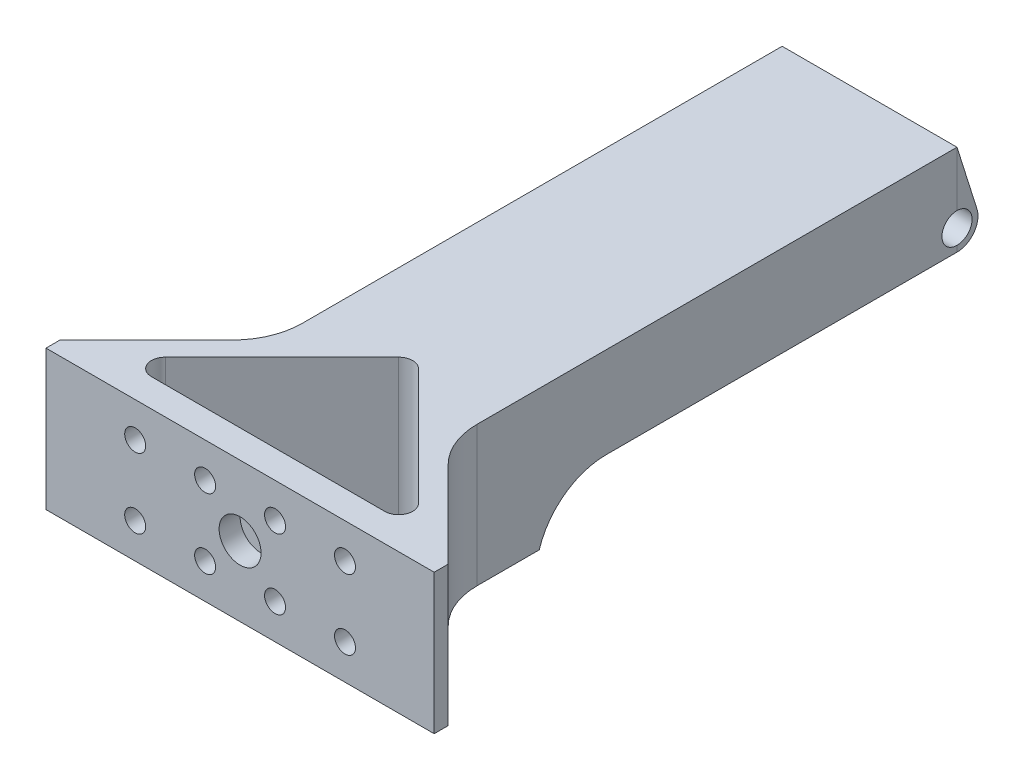
ISO-10303-21;
HEADER;
FILE_DESCRIPTION(('STEP AP214'),'2;1');
FILE_NAME('part.step','',(''),(''),'','','');
FILE_SCHEMA(('AUTOMOTIVE_DESIGN { 1 0 10303 214 1 1 1 1 }'));
ENDSEC;
DATA;
#1=APPLICATION_CONTEXT('core data for automotive mechanical design processes');
#2=APPLICATION_PROTOCOL_DEFINITION('international standard','automotive_design',2000,#1);
#3=PRODUCT_CONTEXT('',#1,'mechanical');
#4=PRODUCT('Part','Part','',(#3));
#5=PRODUCT_RELATED_PRODUCT_CATEGORY('part','',(#4));
#6=PRODUCT_DEFINITION_FORMATION('','',#4);
#7=PRODUCT_DEFINITION_CONTEXT('part definition',#1,'design');
#8=PRODUCT_DEFINITION('design','',#6,#7);
#9=PRODUCT_DEFINITION_SHAPE('','',#8);
#10=(LENGTH_UNIT() NAMED_UNIT(*) SI_UNIT(.MILLI.,.METRE.));
#11=(NAMED_UNIT(*) PLANE_ANGLE_UNIT() SI_UNIT($,.RADIAN.));
#12=(NAMED_UNIT(*) SI_UNIT($,.STERADIAN.) SOLID_ANGLE_UNIT());
#13=UNCERTAINTY_MEASURE_WITH_UNIT(LENGTH_MEASURE(1.E-05),#10,'distance_accuracy_value','');
#14=(GEOMETRIC_REPRESENTATION_CONTEXT(3) GLOBAL_UNCERTAINTY_ASSIGNED_CONTEXT((#13)) GLOBAL_UNIT_ASSIGNED_CONTEXT((#10,
#11,#12)) REPRESENTATION_CONTEXT('',''));
#15=CARTESIAN_POINT('',(0.,0.,0.));
#16=DIRECTION('',(0.,0.,1.));
#17=DIRECTION('',(1.,0.,0.));
#18=AXIS2_PLACEMENT_3D('',#15,#16,#17);
#19=CARTESIAN_POINT('',(40.2522932701939,0.,-90.));
#20=DIRECTION('',(0.,0.,-1.));
#21=DIRECTION('',(-1.,0.,0.));
#22=AXIS2_PLACEMENT_3D('',#19,#20,#21);
#23=PLANE('',#22);
#24=DIRECTION('',(0.,-1.,0.));
#25=VECTOR('',#24,1.);
#26=CARTESIAN_POINT('',(40.2522932701939,0.,-90.));
#27=LINE('',#26,#25);
#28=CARTESIAN_POINT('',(40.2522932701939,7.85000031001889,-90.));
#29=VERTEX_POINT('',#28);
#30=CARTESIAN_POINT('',(40.2522932701939,7.,-90.));
#31=VERTEX_POINT('',#30);
#32=EDGE_CURVE('E209',#29,#31,#27,.T.);
#33=ORIENTED_EDGE('',*,*,#32,.F.);
#34=DIRECTION('',(-1.,0.,0.));
#35=VECTOR('',#34,1.);
#36=CARTESIAN_POINT('',(55.5,7.85000031001889,-90.));
#37=LINE('',#36,#35);
#38=CARTESIAN_POINT('',(40.2477067298061,7.85000031001889,-90.));
#39=VERTEX_POINT('',#38);
#40=EDGE_CURVE('E187',#29,#39,#37,.T.);
#41=ORIENTED_EDGE('',*,*,#40,.T.);
#42=DIRECTION('',(0.,-1.,0.));
#43=VECTOR('',#42,1.);
#44=CARTESIAN_POINT('',(40.2477067298061,20.,-90.));
#45=LINE('',#44,#43);
#46=CARTESIAN_POINT('',(40.2477067298061,7.,-90.));
#47=VERTEX_POINT('',#46);
#48=EDGE_CURVE('E365',#39,#47,#45,.T.);
#49=ORIENTED_EDGE('',*,*,#48,.T.);
#50=DIRECTION('',(-1.,0.,0.));
#51=VECTOR('',#50,1.);
#52=CARTESIAN_POINT('',(40.2522932701939,7.,-90.));
#53=LINE('',#52,#51);
#54=EDGE_CURVE('E226',#31,#47,#53,.T.);
#55=ORIENTED_EDGE('',*,*,#54,.F.);
#56=EDGE_LOOP('',(#33,#41,#49,#55));
#57=FACE_BOUND('',#56,.T.);
#58=ADVANCED_FACE('F34',(#57),#23,.F.);
#59=CARTESIAN_POINT('',(0.,20.,0.));
#60=DIRECTION('',(0.,1.,0.));
#61=DIRECTION('',(0.,0.,1.));
#62=AXIS2_PLACEMENT_3D('',#59,#60,#61);
#63=PLANE('',#62);
#64=DIRECTION('',(1.,0.,0.));
#65=VECTOR('',#64,1.);
#66=CARTESIAN_POINT('',(55.5,20.,0.));
#67=LINE('',#66,#65);
#68=CARTESIAN_POINT('',(0.,20.,0.));
#69=VERTEX_POINT('',#68);
#70=CARTESIAN_POINT('',(55.5,20.,0.));
#71=VERTEX_POINT('',#70);
#72=EDGE_CURVE('E323',#69,#71,#67,.T.);
#73=ORIENTED_EDGE('',*,*,#72,.T.);
#74=DIRECTION('',(0.,0.,-1.));
#75=VECTOR('',#74,1.);
#76=CARTESIAN_POINT('',(55.5,20.,-2.));
#77=LINE('',#76,#75);
#78=CARTESIAN_POINT('',(55.5,20.,-2.));
#79=VERTEX_POINT('',#78);
#80=EDGE_CURVE('E326',#71,#79,#77,.T.);
#81=ORIENTED_EDGE('',*,*,#80,.T.);
#82=DIRECTION('',(-0.707106781186547,0.,-0.707106781186548));
#83=VECTOR('',#82,1.);
#84=CARTESIAN_POINT('',(40.2477067298062,20.,-17.2522932701938));
#85=LINE('',#84,#83);
#86=CARTESIAN_POINT('',(43.1766389179407,20.,-14.3233610820593));
#87=VERTEX_POINT('',#86);
#88=EDGE_CURVE('E329',#79,#87,#85,.T.);
#89=ORIENTED_EDGE('',*,*,#88,.T.);
#90=CARTESIAN_POINT('',(50.2477067298062,20.,-21.3944288939248));
#91=DIRECTION('',(0.,1.,0.));
#92=DIRECTION('',(0.,0.,1.));
#93=AXIS2_PLACEMENT_3D('',#90,#91,#92);
#94=CIRCLE('',#93,10.);
#95=CARTESIAN_POINT('',(40.2477067298062,20.,-21.3944288939248));
#96=VERTEX_POINT('',#95);
#97=EDGE_CURVE('E405',#87,#96,#94,.F.);
#98=ORIENTED_EDGE('',*,*,#97,.T.);
#99=DIRECTION('',(0.,0.,-1.));
#100=VECTOR('',#99,1.);
#101=CARTESIAN_POINT('',(40.2477067298061,20.,-90.));
#102=LINE('',#101,#100);
#103=CARTESIAN_POINT('',(40.2477067298061,20.,-90.));
#104=VERTEX_POINT('',#103);
#105=EDGE_CURVE('E332',#96,#104,#102,.T.);
#106=ORIENTED_EDGE('',*,*,#105,.T.);
#107=DIRECTION('',(-1.,0.,0.));
#108=VECTOR('',#107,1.);
#109=CARTESIAN_POINT('',(40.2477067298061,20.,-90.));
#110=LINE('',#109,#108);
#111=CARTESIAN_POINT('',(15.2522932701939,20.,-90.));
#112=VERTEX_POINT('',#111);
#113=EDGE_CURVE('E334',#104,#112,#110,.T.);
#114=ORIENTED_EDGE('',*,*,#113,.T.);
#115=DIRECTION('',(0.,0.,1.));
#116=VECTOR('',#115,1.);
#117=CARTESIAN_POINT('',(15.2522932701938,20.,-90.));
#118=LINE('',#117,#116);
#119=CARTESIAN_POINT('',(15.2522932701938,20.,-21.3944288939248));
#120=VERTEX_POINT('',#119);
#121=EDGE_CURVE('E337',#112,#120,#118,.T.);
#122=ORIENTED_EDGE('',*,*,#121,.T.);
#123=CARTESIAN_POINT('',(5.25229327019384,20.,-21.3944288939248));
#124=DIRECTION('',(0.,1.,0.));
#125=DIRECTION('',(0.,0.,1.));
#126=AXIS2_PLACEMENT_3D('',#123,#124,#125);
#127=CIRCLE('',#126,10.);
#128=CARTESIAN_POINT('',(12.3233610820593,20.,-14.3233610820593));
#129=VERTEX_POINT('',#128);
#130=EDGE_CURVE('E401',#120,#129,#127,.F.);
#131=ORIENTED_EDGE('',*,*,#130,.T.);
#132=DIRECTION('',(-0.707106781186547,0.,0.707106781186548));
#133=VECTOR('',#132,1.);
#134=CARTESIAN_POINT('',(15.2522932701938,20.,-17.2522932701938));
#135=LINE('',#134,#133);
#136=CARTESIAN_POINT('',(0.,20.,-2.));
#137=VERTEX_POINT('',#136);
#138=EDGE_CURVE('E340',#129,#137,#135,.T.);
#139=ORIENTED_EDGE('',*,*,#138,.T.);
#140=DIRECTION('',(0.,0.,1.));
#141=VECTOR('',#140,1.);
#142=CARTESIAN_POINT('',(0.,20.,-2.));
#143=LINE('',#142,#141);
#144=EDGE_CURVE('E342',#137,#69,#143,.T.);
#145=ORIENTED_EDGE('',*,*,#144,.T.);
#146=EDGE_LOOP('',(#73,#81,#89,#98,#106,#114,#122,#131,#139,#145));
#147=FACE_BOUND('',#146,.T.);
#148=DIRECTION('',(-0.707106781186548,0.,-0.707106781186547));
#149=VECTOR('',#148,1.);
#150=CARTESIAN_POINT('',(45.8431457505076,20.,-7.4142135623731));
#151=LINE('',#150,#149);
#152=CARTESIAN_POINT('',(45.8431457505076,20.,-7.4142135623731));
#153=VERTEX_POINT('',#152);
#154=CARTESIAN_POINT('',(29.1642135623731,20.,-24.0931457505076));
#155=VERTEX_POINT('',#154);
#156=EDGE_CURVE('E279',#153,#155,#151,.T.);
#157=ORIENTED_EDGE('',*,*,#156,.F.);
#158=CARTESIAN_POINT('',(44.4289321881345,20.,-6.));
#159=DIRECTION('',(0.,1.,0.));
#160=DIRECTION('',(0.,0.,1.));
#161=AXIS2_PLACEMENT_3D('',#158,#159,#160);
#162=CIRCLE('',#161,2.);
#163=CARTESIAN_POINT('',(44.4289321881345,20.,-4.));
#164=VERTEX_POINT('',#163);
#165=EDGE_CURVE('E277',#164,#153,#162,.T.);
#166=ORIENTED_EDGE('',*,*,#165,.F.);
#167=DIRECTION('',(1.,0.,0.));
#168=VECTOR('',#167,1.);
#169=CARTESIAN_POINT('',(11.0710678118655,20.,-3.99999999999999));
#170=LINE('',#169,#168);
#171=CARTESIAN_POINT('',(11.0710678118655,20.,-3.99999999999999));
#172=VERTEX_POINT('',#171);
#173=EDGE_CURVE('E289',#172,#164,#170,.T.);
#174=ORIENTED_EDGE('',*,*,#173,.F.);
#175=CARTESIAN_POINT('',(11.0710678118655,20.,-5.99999999999999));
#176=DIRECTION('',(0.,1.,0.));
#177=DIRECTION('',(0.,0.,1.));
#178=AXIS2_PLACEMENT_3D('',#175,#176,#177);
#179=CIRCLE('',#178,2.);
#180=CARTESIAN_POINT('',(9.65685424949239,20.,-7.41421356237309));
#181=VERTEX_POINT('',#180);
#182=EDGE_CURVE('E286',#181,#172,#179,.T.);
#183=ORIENTED_EDGE('',*,*,#182,.F.);
#184=DIRECTION('',(-0.707106781186547,0.,0.707106781186548));
#185=VECTOR('',#184,1.);
#186=CARTESIAN_POINT('',(9.65685424949239,20.,-7.41421356237309));
#187=LINE('',#186,#185);
#188=CARTESIAN_POINT('',(26.3357864376269,20.,-24.0931457505076));
#189=VERTEX_POINT('',#188);
#190=EDGE_CURVE('E284',#189,#181,#187,.T.);
#191=ORIENTED_EDGE('',*,*,#190,.F.);
#192=CARTESIAN_POINT('',(27.75,20.,-22.6789321881345));
#193=DIRECTION('',(0.,1.,0.));
#194=DIRECTION('',(0.,0.,1.));
#195=AXIS2_PLACEMENT_3D('',#192,#193,#194);
#196=CIRCLE('',#195,2.);
#197=EDGE_CURVE('E282',#155,#189,#196,.T.);
#198=ORIENTED_EDGE('',*,*,#197,.F.);
#199=EDGE_LOOP('',(#157,#166,#174,#183,#191,#198));
#200=FACE_BOUND('',#199,.T.);
#201=ADVANCED_FACE('F465',(#147,#200),#63,.T.);
#202=CARTESIAN_POINT('',(0.,0.,0.));
#203=DIRECTION('',(0.,1.,0.));
#204=DIRECTION('',(0.,0.,1.));
#205=AXIS2_PLACEMENT_3D('',#202,#203,#204);
#206=PLANE('',#205);
#207=DIRECTION('',(0.,0.,1.));
#208=VECTOR('',#207,1.);
#209=CARTESIAN_POINT('',(15.2522932701938,0.,-90.));
#210=LINE('',#209,#208);
#211=CARTESIAN_POINT('',(15.2522932701938,0.,-30.27));
#212=VERTEX_POINT('',#211);
#213=CARTESIAN_POINT('',(15.2522932701938,0.,-21.3944288939248));
#214=VERTEX_POINT('',#213);
#215=EDGE_CURVE('E354',#212,#214,#210,.T.);
#216=ORIENTED_EDGE('',*,*,#215,.F.);
#217=DIRECTION('',(-1.,0.,0.));
#218=VECTOR('',#217,1.);
#219=CARTESIAN_POINT('',(40.2477067298061,0.,-30.27));
#220=LINE('',#219,#218);
#221=CARTESIAN_POINT('',(40.2477067298061,0.,-30.27));
#222=VERTEX_POINT('',#221);
#223=EDGE_CURVE('E229',#222,#212,#220,.T.);
#224=ORIENTED_EDGE('',*,*,#223,.F.);
#225=DIRECTION('',(0.,0.,-1.));
#226=VECTOR('',#225,1.);
#227=CARTESIAN_POINT('',(40.2477067298061,0.,-90.));
#228=LINE('',#227,#226);
#229=CARTESIAN_POINT('',(40.2477067298062,0.,-21.3944288939248));
#230=VERTEX_POINT('',#229);
#231=EDGE_CURVE('E352',#230,#222,#228,.T.);
#232=ORIENTED_EDGE('',*,*,#231,.F.);
#233=CARTESIAN_POINT('',(50.2477067298062,0.,-21.3944288939248));
#234=DIRECTION('',(0.,1.,0.));
#235=DIRECTION('',(0.,0.,1.));
#236=AXIS2_PLACEMENT_3D('',#233,#234,#235);
#237=CIRCLE('',#236,10.);
#238=CARTESIAN_POINT('',(43.1766389179407,0.,-14.3233610820593));
#239=VERTEX_POINT('',#238);
#240=EDGE_CURVE('E403',#230,#239,#237,.T.);
#241=ORIENTED_EDGE('',*,*,#240,.T.);
#242=DIRECTION('',(-0.707106781186547,0.,-0.707106781186548));
#243=VECTOR('',#242,1.);
#244=CARTESIAN_POINT('',(40.2477067298062,0.,-17.2522932701938));
#245=LINE('',#244,#243);
#246=CARTESIAN_POINT('',(55.5,0.,-2.));
#247=VERTEX_POINT('',#246);
#248=EDGE_CURVE('E349',#247,#239,#245,.T.);
#249=ORIENTED_EDGE('',*,*,#248,.F.);
#250=DIRECTION('',(0.,0.,-1.));
#251=VECTOR('',#250,1.);
#252=CARTESIAN_POINT('',(55.5,0.,-2.));
#253=LINE('',#252,#251);
#254=CARTESIAN_POINT('',(55.5,0.,0.));
#255=VERTEX_POINT('',#254);
#256=EDGE_CURVE('E347',#255,#247,#253,.T.);
#257=ORIENTED_EDGE('',*,*,#256,.F.);
#258=DIRECTION('',(1.,0.,0.));
#259=VECTOR('',#258,1.);
#260=CARTESIAN_POINT('',(55.5,0.,0.));
#261=LINE('',#260,#259);
#262=CARTESIAN_POINT('',(0.,0.,0.));
#263=VERTEX_POINT('',#262);
#264=EDGE_CURVE('E322',#263,#255,#261,.T.);
#265=ORIENTED_EDGE('',*,*,#264,.F.);
#266=DIRECTION('',(0.,0.,1.));
#267=VECTOR('',#266,1.);
#268=CARTESIAN_POINT('',(0.,0.,-2.));
#269=LINE('',#268,#267);
#270=CARTESIAN_POINT('',(0.,0.,-2.));
#271=VERTEX_POINT('',#270);
#272=EDGE_CURVE('E327',#271,#263,#269,.T.);
#273=ORIENTED_EDGE('',*,*,#272,.F.);
#274=DIRECTION('',(-0.707106781186547,0.,0.707106781186548));
#275=VECTOR('',#274,1.);
#276=CARTESIAN_POINT('',(15.2522932701938,0.,-17.2522932701938));
#277=LINE('',#276,#275);
#278=CARTESIAN_POINT('',(12.3233610820593,0.,-14.3233610820593));
#279=VERTEX_POINT('',#278);
#280=EDGE_CURVE('E357',#279,#271,#277,.T.);
#281=ORIENTED_EDGE('',*,*,#280,.F.);
#282=CARTESIAN_POINT('',(5.25229327019384,0.,-21.3944288939248));
#283=DIRECTION('',(0.,1.,0.));
#284=DIRECTION('',(0.,0.,1.));
#285=AXIS2_PLACEMENT_3D('',#282,#283,#284);
#286=CIRCLE('',#285,10.);
#287=EDGE_CURVE('E399',#279,#214,#286,.T.);
#288=ORIENTED_EDGE('',*,*,#287,.T.);
#289=EDGE_LOOP('',(#216,#224,#232,#241,#249,#257,#265,#273,#281,#288));
#290=FACE_BOUND('',#289,.T.);
#291=CARTESIAN_POINT('',(44.4289321881345,0.,-6.));
#292=DIRECTION('',(0.,1.,0.));
#293=DIRECTION('',(0.,0.,1.));
#294=AXIS2_PLACEMENT_3D('',#291,#292,#293);
#295=CIRCLE('',#294,2.);
#296=CARTESIAN_POINT('',(44.4289321881345,0.,-4.));
#297=VERTEX_POINT('',#296);
#298=CARTESIAN_POINT('',(45.8431457505076,0.,-7.4142135623731));
#299=VERTEX_POINT('',#298);
#300=EDGE_CURVE('E292',#297,#299,#295,.T.);
#301=ORIENTED_EDGE('',*,*,#300,.T.);
#302=DIRECTION('',(-0.707106781186548,0.,-0.707106781186547));
#303=VECTOR('',#302,1.);
#304=CARTESIAN_POINT('',(45.8431457505076,0.,-7.4142135623731));
#305=LINE('',#304,#303);
#306=CARTESIAN_POINT('',(29.1642135623731,0.,-24.0931457505076));
#307=VERTEX_POINT('',#306);
#308=EDGE_CURVE('E295',#299,#307,#305,.T.);
#309=ORIENTED_EDGE('',*,*,#308,.T.);
#310=CARTESIAN_POINT('',(27.75,0.,-22.6789321881345));
#311=DIRECTION('',(0.,1.,0.));
#312=DIRECTION('',(0.,0.,1.));
#313=AXIS2_PLACEMENT_3D('',#310,#311,#312);
#314=CIRCLE('',#313,2.);
#315=CARTESIAN_POINT('',(26.3357864376269,0.,-24.0931457505076));
#316=VERTEX_POINT('',#315);
#317=EDGE_CURVE('E298',#307,#316,#314,.T.);
#318=ORIENTED_EDGE('',*,*,#317,.T.);
#319=DIRECTION('',(-0.707106781186547,0.,0.707106781186548));
#320=VECTOR('',#319,1.);
#321=CARTESIAN_POINT('',(9.65685424949239,0.,-7.41421356237309));
#322=LINE('',#321,#320);
#323=CARTESIAN_POINT('',(9.65685424949239,0.,-7.41421356237309));
#324=VERTEX_POINT('',#323);
#325=EDGE_CURVE('E301',#316,#324,#322,.T.);
#326=ORIENTED_EDGE('',*,*,#325,.T.);
#327=CARTESIAN_POINT('',(11.0710678118655,0.,-5.99999999999999));
#328=DIRECTION('',(0.,1.,0.));
#329=DIRECTION('',(0.,0.,1.));
#330=AXIS2_PLACEMENT_3D('',#327,#328,#329);
#331=CIRCLE('',#330,2.);
#332=CARTESIAN_POINT('',(11.0710678118655,0.,-3.99999999999999));
#333=VERTEX_POINT('',#332);
#334=EDGE_CURVE('E304',#324,#333,#331,.T.);
#335=ORIENTED_EDGE('',*,*,#334,.T.);
#336=DIRECTION('',(1.,0.,0.));
#337=VECTOR('',#336,1.);
#338=CARTESIAN_POINT('',(11.0710678118655,0.,-3.99999999999999));
#339=LINE('',#338,#337);
#340=EDGE_CURVE('E280',#333,#297,#339,.T.);
#341=ORIENTED_EDGE('',*,*,#340,.T.);
#342=EDGE_LOOP('',(#301,#309,#318,#326,#335,#341));
#343=FACE_BOUND('',#342,.T.);
#344=ADVANCED_FACE('F415',(#290,#343),#206,.F.);
#345=CARTESIAN_POINT('',(55.5,20.,0.));
#346=DIRECTION('',(0.,0.,-1.));
#347=DIRECTION('',(-1.,0.,0.));
#348=AXIS2_PLACEMENT_3D('',#345,#346,#347);
#349=PLANE('',#348);
#350=CARTESIAN_POINT('',(27.75,10.,0.));
#351=DIRECTION('',(0.,0.,1.));
#352=DIRECTION('',(1.,0.,0.));
#353=AXIS2_PLACEMENT_3D('',#350,#351,#352);
#354=CIRCLE('',#353,3.);
#355=CARTESIAN_POINT('',(30.75,10.,0.));
#356=VERTEX_POINT('',#355);
#357=EDGE_CURVE('E238',#356,#356,#354,.T.);
#358=ORIENTED_EDGE('',*,*,#357,.F.);
#359=EDGE_LOOP('',(#358));
#360=FACE_BOUND('',#359,.T.);
#361=CARTESIAN_POINT('',(12.75,5.,0.));
#362=DIRECTION('',(0.,0.,1.));
#363=DIRECTION('',(-1.,0.,0.));
#364=AXIS2_PLACEMENT_3D('',#361,#362,#363);
#365=CIRCLE('',#364,1.5);
#366=CARTESIAN_POINT('',(11.25,5.,0.));
#367=VERTEX_POINT('',#366);
#368=EDGE_CURVE('E243',#367,#367,#365,.T.);
#369=ORIENTED_EDGE('',*,*,#368,.F.);
#370=EDGE_LOOP('',(#369));
#371=FACE_BOUND('',#370,.T.);
#372=CARTESIAN_POINT('',(22.75,5.,0.));
#373=DIRECTION('',(0.,0.,1.));
#374=DIRECTION('',(-1.,0.,0.));
#375=AXIS2_PLACEMENT_3D('',#372,#373,#374);
#376=CIRCLE('',#375,1.5);
#377=CARTESIAN_POINT('',(21.25,5.,0.));
#378=VERTEX_POINT('',#377);
#379=EDGE_CURVE('E249',#378,#378,#376,.T.);
#380=ORIENTED_EDGE('',*,*,#379,.F.);
#381=EDGE_LOOP('',(#380));
#382=FACE_BOUND('',#381,.T.);
#383=CARTESIAN_POINT('',(32.75,5.,0.));
#384=DIRECTION('',(0.,0.,1.));
#385=DIRECTION('',(1.,0.,0.));
#386=AXIS2_PLACEMENT_3D('',#383,#384,#385);
#387=CIRCLE('',#386,1.5);
#388=CARTESIAN_POINT('',(34.25,5.,0.));
#389=VERTEX_POINT('',#388);
#390=EDGE_CURVE('E253',#389,#389,#387,.T.);
#391=ORIENTED_EDGE('',*,*,#390,.F.);
#392=EDGE_LOOP('',(#391));
#393=FACE_BOUND('',#392,.T.);
#394=CARTESIAN_POINT('',(42.75,5.,0.));
#395=DIRECTION('',(0.,0.,1.));
#396=DIRECTION('',(1.,0.,0.));
#397=AXIS2_PLACEMENT_3D('',#394,#395,#396);
#398=CIRCLE('',#397,1.5);
#399=CARTESIAN_POINT('',(44.25,5.,0.));
#400=VERTEX_POINT('',#399);
#401=EDGE_CURVE('E257',#400,#400,#398,.T.);
#402=ORIENTED_EDGE('',*,*,#401,.F.);
#403=EDGE_LOOP('',(#402));
#404=FACE_BOUND('',#403,.T.);
#405=CARTESIAN_POINT('',(42.75,15.,0.));
#406=DIRECTION('',(0.,0.,1.));
#407=DIRECTION('',(-1.,0.,0.));
#408=AXIS2_PLACEMENT_3D('',#405,#406,#407);
#409=CIRCLE('',#408,1.5);
#410=CARTESIAN_POINT('',(41.25,15.,0.));
#411=VERTEX_POINT('',#410);
#412=EDGE_CURVE('E261',#411,#411,#409,.T.);
#413=ORIENTED_EDGE('',*,*,#412,.F.);
#414=EDGE_LOOP('',(#413));
#415=FACE_BOUND('',#414,.T.);
#416=CARTESIAN_POINT('',(32.75,15.,0.));
#417=DIRECTION('',(0.,0.,1.));
#418=DIRECTION('',(-1.,0.,0.));
#419=AXIS2_PLACEMENT_3D('',#416,#417,#418);
#420=CIRCLE('',#419,1.5);
#421=CARTESIAN_POINT('',(31.25,15.,0.));
#422=VERTEX_POINT('',#421);
#423=EDGE_CURVE('E265',#422,#422,#420,.T.);
#424=ORIENTED_EDGE('',*,*,#423,.F.);
#425=EDGE_LOOP('',(#424));
#426=FACE_BOUND('',#425,.T.);
#427=CARTESIAN_POINT('',(22.75,15.,0.));
#428=DIRECTION('',(0.,0.,1.));
#429=DIRECTION('',(1.,0.,0.));
#430=AXIS2_PLACEMENT_3D('',#427,#428,#429);
#431=CIRCLE('',#430,1.5);
#432=CARTESIAN_POINT('',(24.25,15.,0.));
#433=VERTEX_POINT('',#432);
#434=EDGE_CURVE('E269',#433,#433,#431,.T.);
#435=ORIENTED_EDGE('',*,*,#434,.F.);
#436=EDGE_LOOP('',(#435));
#437=FACE_BOUND('',#436,.T.);
#438=CARTESIAN_POINT('',(12.75,15.,0.));
#439=DIRECTION('',(0.,0.,1.));
#440=DIRECTION('',(1.,0.,0.));
#441=AXIS2_PLACEMENT_3D('',#438,#439,#440);
#442=CIRCLE('',#441,1.5);
#443=CARTESIAN_POINT('',(14.25,15.,0.));
#444=VERTEX_POINT('',#443);
#445=EDGE_CURVE('E273',#444,#444,#442,.T.);
#446=ORIENTED_EDGE('',*,*,#445,.F.);
#447=EDGE_LOOP('',(#446));
#448=FACE_BOUND('',#447,.T.);
#449=ORIENTED_EDGE('',*,*,#264,.T.);
#450=DIRECTION('',(0.,-1.,0.));
#451=VECTOR('',#450,1.);
#452=CARTESIAN_POINT('',(55.5,20.,0.));
#453=LINE('',#452,#451);
#454=EDGE_CURVE('E370',#71,#255,#453,.T.);
#455=ORIENTED_EDGE('',*,*,#454,.F.);
#456=ORIENTED_EDGE('',*,*,#72,.F.);
#457=DIRECTION('',(0.,-1.,0.));
#458=VECTOR('',#457,1.);
#459=CARTESIAN_POINT('',(0.,20.,0.));
#460=LINE('',#459,#458);
#461=EDGE_CURVE('E344',#69,#263,#460,.T.);
#462=ORIENTED_EDGE('',*,*,#461,.T.);
#463=EDGE_LOOP('',(#449,#455,#456,#462));
#464=FACE_BOUND('',#463,.T.);
#465=ADVANCED_FACE('F450',(#360,#371,#382,#393,#404,#415,#426,#437,#448,#464),#349,.F.);
#466=CARTESIAN_POINT('',(55.5,20.,-2.));
#467=DIRECTION('',(-1.,0.,0.));
#468=DIRECTION('',(0.,0.,1.));
#469=AXIS2_PLACEMENT_3D('',#466,#467,#468);
#470=PLANE('',#469);
#471=ORIENTED_EDGE('',*,*,#256,.T.);
#472=DIRECTION('',(0.,-1.,0.));
#473=VECTOR('',#472,1.);
#474=CARTESIAN_POINT('',(55.5,20.,-2.));
#475=LINE('',#474,#473);
#476=EDGE_CURVE('E367',#79,#247,#475,.T.);
#477=ORIENTED_EDGE('',*,*,#476,.F.);
#478=ORIENTED_EDGE('',*,*,#80,.F.);
#479=ORIENTED_EDGE('',*,*,#454,.T.);
#480=EDGE_LOOP('',(#471,#477,#478,#479));
#481=FACE_BOUND('',#480,.T.);
#482=ADVANCED_FACE('F445',(#481),#470,.F.);
#483=CARTESIAN_POINT('',(40.2477067298062,20.,-17.2522932701938));
#484=DIRECTION('',(-0.707106781186548,0.,0.707106781186547));
#485=DIRECTION('',(0.707106781186547,0.,0.707106781186548));
#486=AXIS2_PLACEMENT_3D('',#483,#484,#485);
#487=PLANE('',#486);
#488=ORIENTED_EDGE('',*,*,#248,.T.);
#489=DIRECTION('',(0.,-1.,0.));
#490=VECTOR('',#489,1.);
#491=CARTESIAN_POINT('',(43.1766389179407,20.,-14.3233610820593));
#492=LINE('',#491,#490);
#493=EDGE_CURVE('E397',#239,#87,#492,.F.);
#494=ORIENTED_EDGE('',*,*,#493,.T.);
#495=ORIENTED_EDGE('',*,*,#88,.F.);
#496=ORIENTED_EDGE('',*,*,#476,.T.);
#497=EDGE_LOOP('',(#488,#494,#495,#496));
#498=FACE_BOUND('',#497,.T.);
#499=ADVANCED_FACE('F441',(#498),#487,.F.);
#500=CARTESIAN_POINT('',(40.2477067298061,20.,-90.));
#501=DIRECTION('',(-1.,0.,0.));
#502=DIRECTION('',(0.,0.,1.));
#503=AXIS2_PLACEMENT_3D('',#500,#501,#502);
#504=PLANE('',#503);
#505=ORIENTED_EDGE('',*,*,#105,.F.);
#506=DIRECTION('',(0.,-1.,0.));
#507=VECTOR('',#506,1.);
#508=CARTESIAN_POINT('',(40.2477067298062,0.,-21.3944288939248));
#509=LINE('',#508,#507);
#510=EDGE_CURVE('E394',#96,#230,#509,.T.);
#511=ORIENTED_EDGE('',*,*,#510,.T.);
#512=ORIENTED_EDGE('',*,*,#231,.T.);
#513=CARTESIAN_POINT('',(40.2477067298062,-3.,-39.8093920141695));
#514=DIRECTION('',(-1.,0.,0.));
#515=DIRECTION('',(0.,0.,1.));
#516=AXIS2_PLACEMENT_3D('',#513,#514,#515);
#517=CIRCLE('',#516,10.);
#518=CARTESIAN_POINT('',(40.2477067298061,7.,-39.8093920141695));
#519=VERTEX_POINT('',#518);
#520=EDGE_CURVE('E11',#222,#519,#517,.T.);
#521=ORIENTED_EDGE('',*,*,#520,.T.);
#522=DIRECTION('',(0.,0.,1.));
#523=VECTOR('',#522,1.);
#524=CARTESIAN_POINT('',(40.2477067298061,7.,-90.));
#525=LINE('',#524,#523);
#526=EDGE_CURVE('E233',#47,#519,#525,.T.);
#527=ORIENTED_EDGE('',*,*,#526,.F.);
#528=ORIENTED_EDGE('',*,*,#48,.F.);
#529=CARTESIAN_POINT('',(40.2477067298061,9.99999921583491,-90.0021690988722));
#530=DIRECTION('',(-1.,0.,0.));
#531=DIRECTION('',(0.,0.,1.));
#532=AXIS2_PLACEMENT_3D('',#529,#530,#531);
#533=CIRCLE('',#532,2.15);
#534=CARTESIAN_POINT('',(40.2477067298061,12.1499981216509,-90.));
#535=VERTEX_POINT('',#534);
#536=EDGE_CURVE('E215',#39,#535,#533,.T.);
#537=ORIENTED_EDGE('',*,*,#536,.T.);
#538=EDGE_CURVE('E202',#104,#535,#45,.T.);
#539=ORIENTED_EDGE('',*,*,#538,.F.);
#540=EDGE_LOOP('',(#505,#511,#512,#521,#527,#528,#537,#539));
#541=FACE_BOUND('',#540,.T.);
#542=ADVANCED_FACE('F424',(#541),#504,.F.);
#543=CARTESIAN_POINT('',(15.2522932701938,20.,-90.));
#544=DIRECTION('',(1.,0.,0.));
#545=DIRECTION('',(0.,0.,-1.));
#546=AXIS2_PLACEMENT_3D('',#543,#544,#545);
#547=PLANE('',#546);
#548=CARTESIAN_POINT('',(15.2522932701939,9.99999921583491,-90.0021690988722));
#549=DIRECTION('',(-1.,0.,0.));
#550=DIRECTION('',(0.,0.,1.));
#551=AXIS2_PLACEMENT_3D('',#548,#549,#550);
#552=CIRCLE('',#551,2.15);
#553=CARTESIAN_POINT('',(15.2522932701939,9.99999921583491,-87.8521690988723));
#554=VERTEX_POINT('',#553);
#555=EDGE_CURVE('E203',#554,#554,#552,.T.);
#556=ORIENTED_EDGE('',*,*,#555,.F.);
#557=EDGE_LOOP('',(#556));
#558=FACE_BOUND('',#557,.T.);
#559=ORIENTED_EDGE('',*,*,#215,.T.);
#560=DIRECTION('',(0.,-1.,0.));
#561=VECTOR('',#560,1.);
#562=CARTESIAN_POINT('',(15.2522932701938,20.,-21.3944288939248));
#563=LINE('',#562,#561);
#564=EDGE_CURVE('E392',#214,#120,#563,.F.);
#565=ORIENTED_EDGE('',*,*,#564,.T.);
#566=ORIENTED_EDGE('',*,*,#121,.F.);
#567=DIRECTION('',(0.,-0.953926650567394,-0.300039906241276));
#568=VECTOR('',#567,1.);
#569=CARTESIAN_POINT('',(15.2522932701939,27.5599245585021,-87.6221661755913));
#570=LINE('',#569,#568);
#571=CARTESIAN_POINT('',(15.2522932701939,10.8041470885303,-92.8923846961659));
#572=VERTEX_POINT('',#571);
#573=EDGE_CURVE('E221',#112,#572,#570,.T.);
#574=ORIENTED_EDGE('',*,*,#573,.T.);
#575=CARTESIAN_POINT('',(15.2522932701939,9.99999921583491,-90.0021690988722));
#576=DIRECTION('',(-1.,0.,0.));
#577=DIRECTION('',(0.,0.,1.));
#578=AXIS2_PLACEMENT_3D('',#575,#576,#577);
#579=CIRCLE('',#578,3.);
#580=CARTESIAN_POINT('',(15.2522932701939,7.,-90.));
#581=VERTEX_POINT('',#580);
#582=EDGE_CURVE('E213',#572,#581,#579,.T.);
#583=ORIENTED_EDGE('',*,*,#582,.T.);
#584=DIRECTION('',(0.,0.,-1.));
#585=VECTOR('',#584,1.);
#586=CARTESIAN_POINT('',(15.2522932701938,7.,-90.));
#587=LINE('',#586,#585);
#588=CARTESIAN_POINT('',(15.2522932701938,7.,-39.8093920141695));
#589=VERTEX_POINT('',#588);
#590=EDGE_CURVE('E192',#589,#581,#587,.T.);
#591=ORIENTED_EDGE('',*,*,#590,.F.);
#592=CARTESIAN_POINT('',(15.2522932701938,-3.,-39.8093920141695));
#593=DIRECTION('',(1.,0.,0.));
#594=DIRECTION('',(0.,0.,-1.));
#595=AXIS2_PLACEMENT_3D('',#592,#593,#594);
#596=CIRCLE('',#595,10.);
#597=EDGE_CURVE('E42',#589,#212,#596,.T.);
#598=ORIENTED_EDGE('',*,*,#597,.T.);
#599=EDGE_LOOP('',(#559,#565,#566,#574,#583,#591,#598));
#600=FACE_BOUND('',#599,.T.);
#601=ADVANCED_FACE('F411',(#558,#600),#547,.F.);
#602=CARTESIAN_POINT('',(15.2522932701938,20.,-17.2522932701938));
#603=DIRECTION('',(0.707106781186548,0.,0.707106781186547));
#604=DIRECTION('',(0.707106781186547,0.,-0.707106781186548));
#605=AXIS2_PLACEMENT_3D('',#602,#603,#604);
#606=PLANE('',#605);
#607=ORIENTED_EDGE('',*,*,#138,.F.);
#608=DIRECTION('',(0.,-1.,0.));
#609=VECTOR('',#608,1.);
#610=CARTESIAN_POINT('',(12.3233610820593,0.,-14.3233610820593));
#611=LINE('',#610,#609);
#612=EDGE_CURVE('E191',#129,#279,#611,.T.);
#613=ORIENTED_EDGE('',*,*,#612,.T.);
#614=ORIENTED_EDGE('',*,*,#280,.T.);
#615=DIRECTION('',(0.,-1.,0.));
#616=VECTOR('',#615,1.);
#617=CARTESIAN_POINT('',(0.,20.,-2.));
#618=LINE('',#617,#616);
#619=EDGE_CURVE('E362',#137,#271,#618,.T.);
#620=ORIENTED_EDGE('',*,*,#619,.F.);
#621=EDGE_LOOP('',(#607,#613,#614,#620));
#622=FACE_BOUND('',#621,.T.);
#623=ADVANCED_FACE('F459',(#622),#606,.F.);
#624=CARTESIAN_POINT('',(0.,20.,-2.));
#625=DIRECTION('',(1.,0.,0.));
#626=DIRECTION('',(0.,0.,-1.));
#627=AXIS2_PLACEMENT_3D('',#624,#625,#626);
#628=PLANE('',#627);
#629=ORIENTED_EDGE('',*,*,#272,.T.);
#630=ORIENTED_EDGE('',*,*,#461,.F.);
#631=ORIENTED_EDGE('',*,*,#144,.F.);
#632=ORIENTED_EDGE('',*,*,#619,.T.);
#633=EDGE_LOOP('',(#629,#630,#631,#632));
#634=FACE_BOUND('',#633,.T.);
#635=ADVANCED_FACE('F455',(#634),#628,.F.);
#636=CARTESIAN_POINT('',(44.4289321881345,20.,-6.));
#637=DIRECTION('',(0.,-1.,0.));
#638=DIRECTION('',(0.,0.,-1.));
#639=AXIS2_PLACEMENT_3D('',#636,#637,#638);
#640=CYLINDRICAL_SURFACE('',#639,2.);
#641=ORIENTED_EDGE('',*,*,#300,.F.);
#642=DIRECTION('',(0.,-1.,0.));
#643=VECTOR('',#642,1.);
#644=CARTESIAN_POINT('',(44.4289321881345,20.,-4.));
#645=LINE('',#644,#643);
#646=EDGE_CURVE('E291',#164,#297,#645,.T.);
#647=ORIENTED_EDGE('',*,*,#646,.F.);
#648=ORIENTED_EDGE('',*,*,#165,.T.);
#649=DIRECTION('',(0.,-1.,0.));
#650=VECTOR('',#649,1.);
#651=CARTESIAN_POINT('',(45.8431457505076,20.,-7.4142135623731));
#652=LINE('',#651,#650);
#653=EDGE_CURVE('E319',#153,#299,#652,.T.);
#654=ORIENTED_EDGE('',*,*,#653,.T.);
#655=EDGE_LOOP('',(#641,#647,#648,#654));
#656=FACE_BOUND('',#655,.T.);
#657=ADVANCED_FACE('F484',(#656),#640,.F.);
#658=CARTESIAN_POINT('',(45.8431457505076,20.,-7.4142135623731));
#659=DIRECTION('',(-0.707106781186547,0.,0.707106781186548));
#660=DIRECTION('',(0.707106781186548,0.,0.707106781186547));
#661=AXIS2_PLACEMENT_3D('',#658,#659,#660);
#662=PLANE('',#661);
#663=ORIENTED_EDGE('',*,*,#308,.F.);
#664=ORIENTED_EDGE('',*,*,#653,.F.);
#665=ORIENTED_EDGE('',*,*,#156,.T.);
#666=DIRECTION('',(0.,-1.,0.));
#667=VECTOR('',#666,1.);
#668=CARTESIAN_POINT('',(29.1642135623731,20.,-24.0931457505076));
#669=LINE('',#668,#667);
#670=EDGE_CURVE('E317',#155,#307,#669,.T.);
#671=ORIENTED_EDGE('',*,*,#670,.T.);
#672=EDGE_LOOP('',(#663,#664,#665,#671));
#673=FACE_BOUND('',#672,.T.);
#674=ADVANCED_FACE('F477',(#673),#662,.T.);
#675=CARTESIAN_POINT('',(27.75,20.,-22.6789321881345));
#676=DIRECTION('',(0.,-1.,0.));
#677=DIRECTION('',(0.,0.,-1.));
#678=AXIS2_PLACEMENT_3D('',#675,#676,#677);
#679=CYLINDRICAL_SURFACE('',#678,2.);
#680=ORIENTED_EDGE('',*,*,#317,.F.);
#681=ORIENTED_EDGE('',*,*,#670,.F.);
#682=ORIENTED_EDGE('',*,*,#197,.T.);
#683=DIRECTION('',(0.,-1.,0.));
#684=VECTOR('',#683,1.);
#685=CARTESIAN_POINT('',(26.3357864376269,20.,-24.0931457505076));
#686=LINE('',#685,#684);
#687=EDGE_CURVE('E315',#189,#316,#686,.T.);
#688=ORIENTED_EDGE('',*,*,#687,.T.);
#689=EDGE_LOOP('',(#680,#681,#682,#688));
#690=FACE_BOUND('',#689,.T.);
#691=ADVANCED_FACE('F480',(#690),#679,.F.);
#692=CARTESIAN_POINT('',(9.65685424949239,20.,-7.41421356237309));
#693=DIRECTION('',(0.707106781186548,0.,0.707106781186547));
#694=DIRECTION('',(0.707106781186547,0.,-0.707106781186548));
#695=AXIS2_PLACEMENT_3D('',#692,#693,#694);
#696=PLANE('',#695);
#697=ORIENTED_EDGE('',*,*,#325,.F.);
#698=ORIENTED_EDGE('',*,*,#687,.F.);
#699=ORIENTED_EDGE('',*,*,#190,.T.);
#700=DIRECTION('',(0.,-1.,0.));
#701=VECTOR('',#700,1.);
#702=CARTESIAN_POINT('',(9.65685424949239,20.,-7.41421356237309));
#703=LINE('',#702,#701);
#704=EDGE_CURVE('E313',#181,#324,#703,.T.);
#705=ORIENTED_EDGE('',*,*,#704,.T.);
#706=EDGE_LOOP('',(#697,#698,#699,#705));
#707=FACE_BOUND('',#706,.T.);
#708=ADVANCED_FACE('F495',(#707),#696,.T.);
#709=CARTESIAN_POINT('',(11.0710678118655,20.,-5.99999999999999));
#710=DIRECTION('',(0.,-1.,0.));
#711=DIRECTION('',(0.,0.,-1.));
#712=AXIS2_PLACEMENT_3D('',#709,#710,#711);
#713=CYLINDRICAL_SURFACE('',#712,2.);
#714=ORIENTED_EDGE('',*,*,#334,.F.);
#715=ORIENTED_EDGE('',*,*,#704,.F.);
#716=ORIENTED_EDGE('',*,*,#182,.T.);
#717=DIRECTION('',(0.,-1.,0.));
#718=VECTOR('',#717,1.);
#719=CARTESIAN_POINT('',(11.0710678118655,20.,-3.99999999999999));
#720=LINE('',#719,#718);
#721=EDGE_CURVE('E311',#172,#333,#720,.T.);
#722=ORIENTED_EDGE('',*,*,#721,.T.);
#723=EDGE_LOOP('',(#714,#715,#716,#722));
#724=FACE_BOUND('',#723,.T.);
#725=ADVANCED_FACE('F492',(#724),#713,.F.);
#726=CARTESIAN_POINT('',(11.0710678118655,20.,-3.99999999999999));
#727=DIRECTION('',(0.,0.,-1.));
#728=DIRECTION('',(-1.,0.,0.));
#729=AXIS2_PLACEMENT_3D('',#726,#727,#728);
#730=PLANE('',#729);
#731=CARTESIAN_POINT('',(12.75,5.,-3.99999999999999));
#732=DIRECTION('',(0.,0.,-1.));
#733=DIRECTION('',(-1.,0.,0.));
#734=AXIS2_PLACEMENT_3D('',#731,#732,#733);
#735=CIRCLE('',#734,1.5);
#736=CARTESIAN_POINT('',(11.25,5.,-3.99999999999999));
#737=VERTEX_POINT('',#736);
#738=EDGE_CURVE('E248',#737,#737,#735,.T.);
#739=ORIENTED_EDGE('',*,*,#738,.F.);
#740=EDGE_LOOP('',(#739));
#741=FACE_BOUND('',#740,.T.);
#742=CARTESIAN_POINT('',(22.75,5.,-4.));
#743=DIRECTION('',(0.,0.,-1.));
#744=DIRECTION('',(-1.,0.,0.));
#745=AXIS2_PLACEMENT_3D('',#742,#743,#744);
#746=CIRCLE('',#745,1.5);
#747=CARTESIAN_POINT('',(21.25,5.,-4.));
#748=VERTEX_POINT('',#747);
#749=EDGE_CURVE('E252',#748,#748,#746,.T.);
#750=ORIENTED_EDGE('',*,*,#749,.F.);
#751=EDGE_LOOP('',(#750));
#752=FACE_BOUND('',#751,.T.);
#753=CARTESIAN_POINT('',(32.75,5.,-4.));
#754=DIRECTION('',(0.,0.,-1.));
#755=DIRECTION('',(-1.,0.,0.));
#756=AXIS2_PLACEMENT_3D('',#753,#754,#755);
#757=CIRCLE('',#756,1.5);
#758=CARTESIAN_POINT('',(31.25,5.,-4.));
#759=VERTEX_POINT('',#758);
#760=EDGE_CURVE('E256',#759,#759,#757,.T.);
#761=ORIENTED_EDGE('',*,*,#760,.F.);
#762=EDGE_LOOP('',(#761));
#763=FACE_BOUND('',#762,.T.);
#764=CARTESIAN_POINT('',(42.75,5.,-4.));
#765=DIRECTION('',(0.,0.,-1.));
#766=DIRECTION('',(-1.,0.,0.));
#767=AXIS2_PLACEMENT_3D('',#764,#765,#766);
#768=CIRCLE('',#767,1.5);
#769=CARTESIAN_POINT('',(41.25,5.,-4.));
#770=VERTEX_POINT('',#769);
#771=EDGE_CURVE('E260',#770,#770,#768,.T.);
#772=ORIENTED_EDGE('',*,*,#771,.F.);
#773=EDGE_LOOP('',(#772));
#774=FACE_BOUND('',#773,.T.);
#775=CARTESIAN_POINT('',(42.75,15.,-4.));
#776=DIRECTION('',(0.,0.,-1.));
#777=DIRECTION('',(-1.,0.,0.));
#778=AXIS2_PLACEMENT_3D('',#775,#776,#777);
#779=CIRCLE('',#778,1.5);
#780=CARTESIAN_POINT('',(41.25,15.,-4.));
#781=VERTEX_POINT('',#780);
#782=EDGE_CURVE('E264',#781,#781,#779,.T.);
#783=ORIENTED_EDGE('',*,*,#782,.F.);
#784=EDGE_LOOP('',(#783));
#785=FACE_BOUND('',#784,.T.);
#786=CARTESIAN_POINT('',(32.75,15.,-4.));
#787=DIRECTION('',(0.,0.,-1.));
#788=DIRECTION('',(-1.,0.,0.));
#789=AXIS2_PLACEMENT_3D('',#786,#787,#788);
#790=CIRCLE('',#789,1.5);
#791=CARTESIAN_POINT('',(31.25,15.,-4.));
#792=VERTEX_POINT('',#791);
#793=EDGE_CURVE('E268',#792,#792,#790,.T.);
#794=ORIENTED_EDGE('',*,*,#793,.F.);
#795=EDGE_LOOP('',(#794));
#796=FACE_BOUND('',#795,.T.);
#797=CARTESIAN_POINT('',(22.75,15.,-4.));
#798=DIRECTION('',(0.,0.,-1.));
#799=DIRECTION('',(-1.,0.,0.));
#800=AXIS2_PLACEMENT_3D('',#797,#798,#799);
#801=CIRCLE('',#800,1.5);
#802=CARTESIAN_POINT('',(21.25,15.,-4.));
#803=VERTEX_POINT('',#802);
#804=EDGE_CURVE('E272',#803,#803,#801,.T.);
#805=ORIENTED_EDGE('',*,*,#804,.F.);
#806=EDGE_LOOP('',(#805));
#807=FACE_BOUND('',#806,.T.);
#808=CARTESIAN_POINT('',(12.75,15.,-3.99999999999999));
#809=DIRECTION('',(0.,0.,-1.));
#810=DIRECTION('',(-1.,0.,0.));
#811=AXIS2_PLACEMENT_3D('',#808,#809,#810);
#812=CIRCLE('',#811,1.5);
#813=CARTESIAN_POINT('',(11.25,15.,-3.99999999999999));
#814=VERTEX_POINT('',#813);
#815=EDGE_CURVE('E276',#814,#814,#812,.T.);
#816=ORIENTED_EDGE('',*,*,#815,.F.);
#817=EDGE_LOOP('',(#816));
#818=FACE_BOUND('',#817,.T.);
#819=ORIENTED_EDGE('',*,*,#340,.F.);
#820=ORIENTED_EDGE('',*,*,#721,.F.);
#821=ORIENTED_EDGE('',*,*,#173,.T.);
#822=ORIENTED_EDGE('',*,*,#646,.T.);
#823=EDGE_LOOP('',(#819,#820,#821,#822));
#824=FACE_BOUND('',#823,.T.);
#825=ADVANCED_FACE('F488',(#741,#752,#763,#774,#785,#796,#807,#818,#824),#730,.T.);
#826=CARTESIAN_POINT('',(12.75,15.,-5.));
#827=DIRECTION('',(0.,0.,1.));
#828=DIRECTION('',(1.,0.,0.));
#829=AXIS2_PLACEMENT_3D('',#826,#827,#828);
#830=CYLINDRICAL_SURFACE('',#829,1.5);
#831=ORIENTED_EDGE('',*,*,#815,.T.);
#832=EDGE_LOOP('',(#831));
#833=FACE_BOUND('',#832,.T.);
#834=ORIENTED_EDGE('',*,*,#445,.T.);
#835=EDGE_LOOP('',(#834));
#836=FACE_BOUND('',#835,.T.);
#837=ADVANCED_FACE('F554',(#833,#836),#830,.F.);
#838=CARTESIAN_POINT('',(22.75,15.,-5.));
#839=DIRECTION('',(0.,0.,1.));
#840=DIRECTION('',(1.,0.,0.));
#841=AXIS2_PLACEMENT_3D('',#838,#839,#840);
#842=CYLINDRICAL_SURFACE('',#841,1.5);
#843=ORIENTED_EDGE('',*,*,#804,.T.);
#844=EDGE_LOOP('',(#843));
#845=FACE_BOUND('',#844,.T.);
#846=ORIENTED_EDGE('',*,*,#434,.T.);
#847=EDGE_LOOP('',(#846));
#848=FACE_BOUND('',#847,.T.);
#849=ADVANCED_FACE('F550',(#845,#848),#842,.F.);
#850=CARTESIAN_POINT('',(32.75,15.,-5.));
#851=DIRECTION('',(0.,0.,1.));
#852=DIRECTION('',(1.,0.,0.));
#853=AXIS2_PLACEMENT_3D('',#850,#851,#852);
#854=CYLINDRICAL_SURFACE('',#853,1.5);
#855=ORIENTED_EDGE('',*,*,#793,.T.);
#856=EDGE_LOOP('',(#855));
#857=FACE_BOUND('',#856,.T.);
#858=ORIENTED_EDGE('',*,*,#423,.T.);
#859=EDGE_LOOP('',(#858));
#860=FACE_BOUND('',#859,.T.);
#861=ADVANCED_FACE('F546',(#857,#860),#854,.F.);
#862=CARTESIAN_POINT('',(42.75,15.,-5.));
#863=DIRECTION('',(0.,0.,1.));
#864=DIRECTION('',(1.,0.,0.));
#865=AXIS2_PLACEMENT_3D('',#862,#863,#864);
#866=CYLINDRICAL_SURFACE('',#865,1.5);
#867=ORIENTED_EDGE('',*,*,#782,.T.);
#868=EDGE_LOOP('',(#867));
#869=FACE_BOUND('',#868,.T.);
#870=ORIENTED_EDGE('',*,*,#412,.T.);
#871=EDGE_LOOP('',(#870));
#872=FACE_BOUND('',#871,.T.);
#873=ADVANCED_FACE('F542',(#869,#872),#866,.F.);
#874=CARTESIAN_POINT('',(42.75,5.,-5.));
#875=DIRECTION('',(0.,0.,1.));
#876=DIRECTION('',(1.,0.,0.));
#877=AXIS2_PLACEMENT_3D('',#874,#875,#876);
#878=CYLINDRICAL_SURFACE('',#877,1.5);
#879=ORIENTED_EDGE('',*,*,#771,.T.);
#880=EDGE_LOOP('',(#879));
#881=FACE_BOUND('',#880,.T.);
#882=ORIENTED_EDGE('',*,*,#401,.T.);
#883=EDGE_LOOP('',(#882));
#884=FACE_BOUND('',#883,.T.);
#885=ADVANCED_FACE('F538',(#881,#884),#878,.F.);
#886=CARTESIAN_POINT('',(32.75,5.,-5.));
#887=DIRECTION('',(0.,0.,1.));
#888=DIRECTION('',(1.,0.,0.));
#889=AXIS2_PLACEMENT_3D('',#886,#887,#888);
#890=CYLINDRICAL_SURFACE('',#889,1.5);
#891=ORIENTED_EDGE('',*,*,#760,.T.);
#892=EDGE_LOOP('',(#891));
#893=FACE_BOUND('',#892,.T.);
#894=ORIENTED_EDGE('',*,*,#390,.T.);
#895=EDGE_LOOP('',(#894));
#896=FACE_BOUND('',#895,.T.);
#897=ADVANCED_FACE('F534',(#893,#896),#890,.F.);
#898=CARTESIAN_POINT('',(22.75,5.,-5.));
#899=DIRECTION('',(0.,0.,1.));
#900=DIRECTION('',(1.,0.,0.));
#901=AXIS2_PLACEMENT_3D('',#898,#899,#900);
#902=CYLINDRICAL_SURFACE('',#901,1.5);
#903=ORIENTED_EDGE('',*,*,#749,.T.);
#904=EDGE_LOOP('',(#903));
#905=FACE_BOUND('',#904,.T.);
#906=ORIENTED_EDGE('',*,*,#379,.T.);
#907=EDGE_LOOP('',(#906));
#908=FACE_BOUND('',#907,.T.);
#909=ADVANCED_FACE('F530',(#905,#908),#902,.F.);
#910=CARTESIAN_POINT('',(12.75,5.,-5.));
#911=DIRECTION('',(0.,0.,1.));
#912=DIRECTION('',(1.,0.,0.));
#913=AXIS2_PLACEMENT_3D('',#910,#911,#912);
#914=CYLINDRICAL_SURFACE('',#913,1.5);
#915=ORIENTED_EDGE('',*,*,#738,.T.);
#916=EDGE_LOOP('',(#915));
#917=FACE_BOUND('',#916,.T.);
#918=ORIENTED_EDGE('',*,*,#368,.T.);
#919=EDGE_LOOP('',(#918));
#920=FACE_BOUND('',#919,.T.);
#921=ADVANCED_FACE('F526',(#917,#920),#914,.F.);
#922=CARTESIAN_POINT('',(27.75,10.,-3.));
#923=DIRECTION('',(0.,0.,1.));
#924=DIRECTION('',(1.,0.,0.));
#925=AXIS2_PLACEMENT_3D('',#922,#923,#924);
#926=CYLINDRICAL_SURFACE('',#925,3.);
#927=CARTESIAN_POINT('',(27.75,10.,-3.));
#928=DIRECTION('',(0.,0.,1.));
#929=DIRECTION('',(1.,0.,0.));
#930=AXIS2_PLACEMENT_3D('',#927,#928,#929);
#931=CIRCLE('',#930,3.);
#932=CARTESIAN_POINT('',(30.75,10.,-3.));
#933=VERTEX_POINT('',#932);
#934=EDGE_CURVE('E240',#933,#933,#931,.T.);
#935=ORIENTED_EDGE('',*,*,#934,.F.);
#936=EDGE_LOOP('',(#935));
#937=FACE_BOUND('',#936,.T.);
#938=ORIENTED_EDGE('',*,*,#357,.T.);
#939=EDGE_LOOP('',(#938));
#940=FACE_BOUND('',#939,.T.);
#941=ADVANCED_FACE('F520',(#937,#940),#926,.F.);
#942=CARTESIAN_POINT('',(27.75,10.,-3.));
#943=DIRECTION('',(0.,0.,1.));
#944=DIRECTION('',(1.,0.,0.));
#945=AXIS2_PLACEMENT_3D('',#942,#943,#944);
#946=PLANE('',#945);
#947=ORIENTED_EDGE('',*,*,#934,.T.);
#948=EDGE_LOOP('',(#947));
#949=FACE_BOUND('',#948,.T.);
#950=ADVANCED_FACE('F516',(#949),#946,.T.);
#951=CARTESIAN_POINT('',(0.,7.,0.));
#952=DIRECTION('',(0.,-1.,0.));
#953=DIRECTION('',(0.,0.,-1.));
#954=AXIS2_PLACEMENT_3D('',#951,#952,#953);
#955=PLANE('',#954);
#956=ORIENTED_EDGE('',*,*,#526,.T.);
#957=DIRECTION('',(1.,0.,0.));
#958=VECTOR('',#957,1.);
#959=CARTESIAN_POINT('',(15.2522932701938,7.,-39.8093920141695));
#960=LINE('',#959,#958);
#961=EDGE_CURVE('E407',#519,#589,#960,.F.);
#962=ORIENTED_EDGE('',*,*,#961,.T.);
#963=ORIENTED_EDGE('',*,*,#590,.T.);
#964=DIRECTION('',(1.,0.,0.));
#965=VECTOR('',#964,1.);
#966=CARTESIAN_POINT('',(40.2477067298061,7.,-90.));
#967=LINE('',#966,#965);
#968=EDGE_CURVE('E235',#581,#47,#967,.T.);
#969=ORIENTED_EDGE('',*,*,#968,.T.);
#970=EDGE_LOOP('',(#956,#962,#963,#969));
#971=FACE_BOUND('',#970,.T.);
#972=ADVANCED_FACE('F420',(#971),#955,.T.);
#973=ORIENTED_EDGE('',*,*,#538,.T.);
#974=DIRECTION('',(-1.,0.,0.));
#975=VECTOR('',#974,1.);
#976=CARTESIAN_POINT('',(55.5,12.1499981216509,-90.));
#977=LINE('',#976,#975);
#978=CARTESIAN_POINT('',(40.2522932701939,12.1499981216509,-90.));
#979=VERTEX_POINT('',#978);
#980=EDGE_CURVE('E184',#535,#979,#977,.F.);
#981=ORIENTED_EDGE('',*,*,#980,.T.);
#982=CARTESIAN_POINT('',(40.2522932701939,20.,-90.));
#983=VERTEX_POINT('',#982);
#984=EDGE_CURVE('E199',#983,#979,#27,.T.);
#985=ORIENTED_EDGE('',*,*,#984,.F.);
#986=DIRECTION('',(-1.,0.,0.));
#987=VECTOR('',#986,1.);
#988=CARTESIAN_POINT('',(40.2522932701939,20.,-90.));
#989=LINE('',#988,#987);
#990=EDGE_CURVE('E220',#983,#104,#989,.T.);
#991=ORIENTED_EDGE('',*,*,#990,.T.);
#992=EDGE_LOOP('',(#973,#981,#985,#991));
#993=FACE_BOUND('',#992,.T.);
#994=ADVANCED_FACE('F197',(#993),#23,.F.);
#995=CARTESIAN_POINT('',(40.2522932701939,9.99999921583491,-90.0021690988722));
#996=DIRECTION('',(-1.,0.,0.));
#997=DIRECTION('',(0.,0.,1.));
#998=AXIS2_PLACEMENT_3D('',#995,#996,#997);
#999=CYLINDRICAL_SURFACE('',#998,3.);
#1000=ORIENTED_EDGE('',*,*,#582,.F.);
#1001=DIRECTION('',(-1.,0.,0.));
#1002=VECTOR('',#1001,1.);
#1003=CARTESIAN_POINT('',(40.2522932701939,10.8041470885303,-92.8923846961659));
#1004=LINE('',#1003,#1002);
#1005=CARTESIAN_POINT('',(40.2522932701939,10.8041470885303,-92.8923846961659));
#1006=VERTEX_POINT('',#1005);
#1007=EDGE_CURVE('E230',#1006,#572,#1004,.T.);
#1008=ORIENTED_EDGE('',*,*,#1007,.F.);
#1009=CARTESIAN_POINT('',(40.2522932701939,9.99999921583491,-90.0021690988722));
#1010=DIRECTION('',(-1.,0.,0.));
#1011=DIRECTION('',(0.,0.,1.));
#1012=AXIS2_PLACEMENT_3D('',#1009,#1010,#1011);
#1013=CIRCLE('',#1012,3.);
#1014=EDGE_CURVE('E211',#1006,#31,#1013,.T.);
#1015=ORIENTED_EDGE('',*,*,#1014,.T.);
#1016=ORIENTED_EDGE('',*,*,#54,.T.);
#1017=ORIENTED_EDGE('',*,*,#968,.F.);
#1018=EDGE_LOOP('',(#1000,#1008,#1015,#1016,#1017));
#1019=FACE_BOUND('',#1018,.T.);
#1020=ADVANCED_FACE('F429',(#1019),#999,.T.);
#1021=CARTESIAN_POINT('',(40.2522932701939,27.5599245585021,-87.6221661755913));
#1022=DIRECTION('',(0.,0.300039906241276,-0.953926650567394));
#1023=DIRECTION('',(0.,0.953926650567394,0.300039906241276));
#1024=AXIS2_PLACEMENT_3D('',#1021,#1022,#1023);
#1025=PLANE('',#1024);
#1026=ORIENTED_EDGE('',*,*,#573,.F.);
#1027=ORIENTED_EDGE('',*,*,#113,.F.);
#1028=ORIENTED_EDGE('',*,*,#990,.F.);
#1029=DIRECTION('',(0.,-0.953926650567394,-0.300039906241276));
#1030=VECTOR('',#1029,1.);
#1031=CARTESIAN_POINT('',(40.2522932701939,27.5599245585021,-87.6221661755913));
#1032=LINE('',#1031,#1030);
#1033=EDGE_CURVE('E208',#983,#1006,#1032,.T.);
#1034=ORIENTED_EDGE('',*,*,#1033,.T.);
#1035=ORIENTED_EDGE('',*,*,#1007,.T.);
#1036=EDGE_LOOP('',(#1026,#1027,#1028,#1034,#1035));
#1037=FACE_BOUND('',#1036,.T.);
#1038=ADVANCED_FACE('F431',(#1037),#1025,.T.);
#1039=CARTESIAN_POINT('',(40.2522932701938,0.,0.));
#1040=DIRECTION('',(-1.,0.,0.));
#1041=DIRECTION('',(0.,0.,1.));
#1042=AXIS2_PLACEMENT_3D('',#1039,#1040,#1041);
#1043=PLANE('',#1042);
#1044=ORIENTED_EDGE('',*,*,#984,.T.);
#1045=CARTESIAN_POINT('',(40.2522932701939,9.99999921583491,-90.0021690988722));
#1046=DIRECTION('',(-1.,0.,0.));
#1047=DIRECTION('',(0.,0.,1.));
#1048=AXIS2_PLACEMENT_3D('',#1045,#1046,#1047);
#1049=CIRCLE('',#1048,2.15);
#1050=EDGE_CURVE('E181',#979,#29,#1049,.T.);
#1051=ORIENTED_EDGE('',*,*,#1050,.T.);
#1052=ORIENTED_EDGE('',*,*,#32,.T.);
#1053=ORIENTED_EDGE('',*,*,#1014,.F.);
#1054=ORIENTED_EDGE('',*,*,#1033,.F.);
#1055=EDGE_LOOP('',(#1044,#1051,#1052,#1053,#1054));
#1056=FACE_BOUND('',#1055,.T.);
#1057=ADVANCED_FACE('F205',(#1056),#1043,.F.);
#1058=CARTESIAN_POINT('',(55.5,9.99999921583491,-90.0021690988722));
#1059=DIRECTION('',(-1.,0.,0.));
#1060=DIRECTION('',(0.,0.,1.));
#1061=AXIS2_PLACEMENT_3D('',#1058,#1059,#1060);
#1062=CYLINDRICAL_SURFACE('',#1061,2.15);
#1063=ORIENTED_EDGE('',*,*,#555,.T.);
#1064=EDGE_LOOP('',(#1063));
#1065=FACE_BOUND('',#1064,.T.);
#1066=ORIENTED_EDGE('',*,*,#40,.F.);
#1067=ORIENTED_EDGE('',*,*,#1050,.F.);
#1068=ORIENTED_EDGE('',*,*,#980,.F.);
#1069=ORIENTED_EDGE('',*,*,#536,.F.);
#1070=EDGE_LOOP('',(#1066,#1067,#1068,#1069));
#1071=FACE_BOUND('',#1070,.T.);
#1072=ADVANCED_FACE('F183',(#1065,#1071),#1062,.F.);
#1073=CARTESIAN_POINT('',(5.25229327019384,20.,-21.3944288939248));
#1074=DIRECTION('',(0.,1.,0.));
#1075=DIRECTION('',(0.,0.,1.));
#1076=AXIS2_PLACEMENT_3D('',#1073,#1074,#1075);
#1077=CYLINDRICAL_SURFACE('',#1076,10.);
#1078=ORIENTED_EDGE('',*,*,#130,.F.);
#1079=ORIENTED_EDGE('',*,*,#564,.F.);
#1080=ORIENTED_EDGE('',*,*,#287,.F.);
#1081=ORIENTED_EDGE('',*,*,#612,.F.);
#1082=EDGE_LOOP('',(#1078,#1079,#1080,#1081));
#1083=FACE_BOUND('',#1082,.T.);
#1084=ADVANCED_FACE('F463',(#1083),#1077,.F.);
#1085=CARTESIAN_POINT('',(50.2477067298062,20.,-21.3944288939248));
#1086=DIRECTION('',(0.,1.,0.));
#1087=DIRECTION('',(0.,0.,1.));
#1088=AXIS2_PLACEMENT_3D('',#1085,#1086,#1087);
#1089=CYLINDRICAL_SURFACE('',#1088,10.);
#1090=ORIENTED_EDGE('',*,*,#97,.F.);
#1091=ORIENTED_EDGE('',*,*,#493,.F.);
#1092=ORIENTED_EDGE('',*,*,#240,.F.);
#1093=ORIENTED_EDGE('',*,*,#510,.F.);
#1094=EDGE_LOOP('',(#1090,#1091,#1092,#1093));
#1095=FACE_BOUND('',#1094,.T.);
#1096=ADVANCED_FACE('F437',(#1095),#1089,.F.);
#1097=CARTESIAN_POINT('',(40.2477067298061,-3.,-39.8093920141695));
#1098=DIRECTION('',(-1.,0.,0.));
#1099=DIRECTION('',(0.,0.,1.));
#1100=AXIS2_PLACEMENT_3D('',#1097,#1098,#1099);
#1101=CYLINDRICAL_SURFACE('',#1100,10.);
#1102=ORIENTED_EDGE('',*,*,#520,.F.);
#1103=ORIENTED_EDGE('',*,*,#223,.T.);
#1104=ORIENTED_EDGE('',*,*,#597,.F.);
#1105=ORIENTED_EDGE('',*,*,#961,.F.);
#1106=EDGE_LOOP('',(#1102,#1103,#1104,#1105));
#1107=FACE_BOUND('',#1106,.T.);
#1108=ADVANCED_FACE('F36',(#1107),#1101,.F.);
#1109=CLOSED_SHELL('',(#58,#201,#344,#465,#482,#499,#542,#601,#623,#635,#657,#674,#691,#708,
#725,#825,#837,#849,#861,#873,#885,#897,#909,#921,#941,#950,#972,#994,#1020,#1038,#1057,#1072,
#1084,#1096,#1108));
#1110=MANIFOLD_SOLID_BREP('B2',#1109);
#1111=ADVANCED_BREP_SHAPE_REPRESENTATION('',(#18,#1110),#14);
#1112=SHAPE_DEFINITION_REPRESENTATION(#9,#1111);
ENDSEC;
END-ISO-10303-21;
